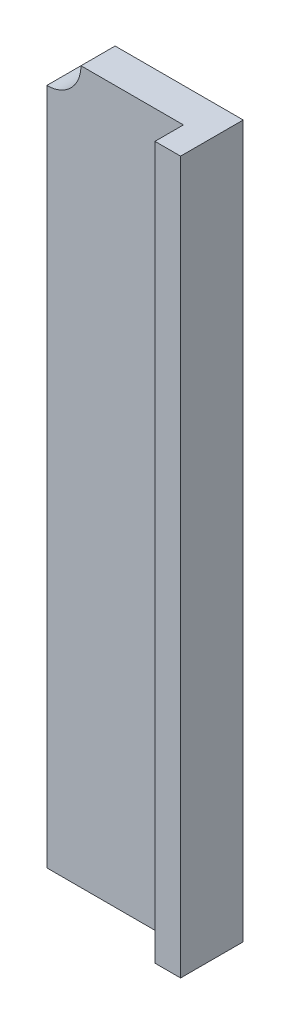
ISO-10303-21;
HEADER;
FILE_DESCRIPTION(('STEP AP214'),'2;1');
FILE_NAME('part.step','',(''),(''),'','','');
FILE_SCHEMA(('AUTOMOTIVE_DESIGN { 1 0 10303 214 1 1 1 1 }'));
ENDSEC;
DATA;
#1=APPLICATION_CONTEXT('core data for automotive mechanical design processes');
#2=APPLICATION_PROTOCOL_DEFINITION('international standard','automotive_design',2000,#1);
#3=PRODUCT_CONTEXT('',#1,'mechanical');
#4=PRODUCT('Part','Part','',(#3));
#5=PRODUCT_RELATED_PRODUCT_CATEGORY('part','',(#4));
#6=PRODUCT_DEFINITION_FORMATION('','',#4);
#7=PRODUCT_DEFINITION_CONTEXT('part definition',#1,'design');
#8=PRODUCT_DEFINITION('design','',#6,#7);
#9=PRODUCT_DEFINITION_SHAPE('','',#8);
#10=(LENGTH_UNIT() NAMED_UNIT(*) SI_UNIT(.MILLI.,.METRE.));
#11=(NAMED_UNIT(*) PLANE_ANGLE_UNIT() SI_UNIT($,.RADIAN.));
#12=(NAMED_UNIT(*) SI_UNIT($,.STERADIAN.) SOLID_ANGLE_UNIT());
#13=UNCERTAINTY_MEASURE_WITH_UNIT(LENGTH_MEASURE(1.E-05),#10,'distance_accuracy_value','');
#14=(GEOMETRIC_REPRESENTATION_CONTEXT(3) GLOBAL_UNCERTAINTY_ASSIGNED_CONTEXT((#13)) GLOBAL_UNIT_ASSIGNED_CONTEXT((#10,
#11,#12)) REPRESENTATION_CONTEXT('',''));
#15=CARTESIAN_POINT('',(0.,0.,0.));
#16=DIRECTION('',(0.,0.,1.));
#17=DIRECTION('',(1.,0.,0.));
#18=AXIS2_PLACEMENT_3D('',#15,#16,#17);
#19=CARTESIAN_POINT('',(0.,0.,6.));
#20=DIRECTION('',(0.,0.,-1.));
#21=DIRECTION('',(-1.,0.,0.));
#22=AXIS2_PLACEMENT_3D('',#19,#20,#21);
#23=PLANE('',#22);
#24=DIRECTION('',(-1.,0.,0.));
#25=VECTOR('',#24,1.);
#26=CARTESIAN_POINT('',(0.,125.,6.));
#27=LINE('',#26,#25);
#28=CARTESIAN_POINT('',(24.,125.,6.));
#29=VERTEX_POINT('',#28);
#30=CARTESIAN_POINT('',(6.,125.,6.));
#31=VERTEX_POINT('',#30);
#32=EDGE_CURVE('E116',#29,#31,#27,.T.);
#33=ORIENTED_EDGE('',*,*,#32,.T.);
#34=CARTESIAN_POINT('',(0.,125.,6.));
#35=DIRECTION('',(0.,0.,1.));
#36=DIRECTION('',(1.,0.,0.));
#37=AXIS2_PLACEMENT_3D('',#34,#35,#36);
#38=CIRCLE('',#37,6.);
#39=CARTESIAN_POINT('',(0.,119.,6.));
#40=VERTEX_POINT('',#39);
#41=EDGE_CURVE('E149',#40,#31,#38,.T.);
#42=ORIENTED_EDGE('',*,*,#41,.F.);
#43=DIRECTION('',(0.,-1.,0.));
#44=VECTOR('',#43,1.);
#45=CARTESIAN_POINT('',(0.,0.,6.));
#46=LINE('',#45,#44);
#47=CARTESIAN_POINT('',(0.,0.,6.));
#48=VERTEX_POINT('',#47);
#49=EDGE_CURVE('E102',#40,#48,#46,.T.);
#50=ORIENTED_EDGE('',*,*,#49,.T.);
#51=DIRECTION('',(1.,0.,0.));
#52=VECTOR('',#51,1.);
#53=CARTESIAN_POINT('',(0.,0.,6.));
#54=LINE('',#53,#52);
#55=CARTESIAN_POINT('',(24.,0.,6.));
#56=VERTEX_POINT('',#55);
#57=EDGE_CURVE('E131',#48,#56,#54,.T.);
#58=ORIENTED_EDGE('',*,*,#57,.T.);
#59=DIRECTION('',(0.,-1.,0.));
#60=VECTOR('',#59,1.);
#61=CARTESIAN_POINT('',(24.,0.,6.));
#62=LINE('',#61,#60);
#63=EDGE_CURVE('E55',#29,#56,#62,.T.);
#64=ORIENTED_EDGE('',*,*,#63,.F.);
#65=EDGE_LOOP('',(#33,#42,#50,#58,#64));
#66=FACE_BOUND('',#65,.T.);
#67=ADVANCED_FACE('F33',(#66),#23,.F.);
#68=CARTESIAN_POINT('',(0.,0.,6.));
#69=DIRECTION('',(1.,0.,0.));
#70=DIRECTION('',(0.,0.,-1.));
#71=AXIS2_PLACEMENT_3D('',#68,#69,#70);
#72=PLANE('',#71);
#73=ORIENTED_EDGE('',*,*,#49,.F.);
#74=DIRECTION('',(0.,0.,1.));
#75=VECTOR('',#74,1.);
#76=CARTESIAN_POINT('',(0.,119.,0.));
#77=LINE('',#76,#75);
#78=CARTESIAN_POINT('',(0.,119.,0.));
#79=VERTEX_POINT('',#78);
#80=EDGE_CURVE('E91',#40,#79,#77,.F.);
#81=ORIENTED_EDGE('',*,*,#80,.T.);
#82=DIRECTION('',(0.,-1.,0.));
#83=VECTOR('',#82,1.);
#84=CARTESIAN_POINT('',(0.,0.,0.));
#85=LINE('',#84,#83);
#86=CARTESIAN_POINT('',(0.,0.,0.));
#87=VERTEX_POINT('',#86);
#88=EDGE_CURVE('E100',#79,#87,#85,.T.);
#89=ORIENTED_EDGE('',*,*,#88,.T.);
#90=DIRECTION('',(0.,0.,-1.));
#91=VECTOR('',#90,1.);
#92=CARTESIAN_POINT('',(0.,0.,6.));
#93=LINE('',#92,#91);
#94=EDGE_CURVE('E41',#48,#87,#93,.T.);
#95=ORIENTED_EDGE('',*,*,#94,.F.);
#96=EDGE_LOOP('',(#73,#81,#89,#95));
#97=FACE_BOUND('',#96,.T.);
#98=ADVANCED_FACE('F35',(#97),#72,.F.);
#99=CARTESIAN_POINT('',(0.,0.,6.));
#100=DIRECTION('',(0.,1.,0.));
#101=DIRECTION('',(0.,0.,1.));
#102=AXIS2_PLACEMENT_3D('',#99,#100,#101);
#103=PLANE('',#102);
#104=DIRECTION('',(1.,0.,0.));
#105=VECTOR('',#104,1.);
#106=CARTESIAN_POINT('',(0.,0.,0.));
#107=LINE('',#106,#105);
#108=CARTESIAN_POINT('',(28.5,0.,0.));
#109=VERTEX_POINT('',#108);
#110=EDGE_CURVE('E106',#87,#109,#107,.T.);
#111=ORIENTED_EDGE('',*,*,#110,.T.);
#112=DIRECTION('',(0.,0.,-1.));
#113=VECTOR('',#112,1.);
#114=CARTESIAN_POINT('',(28.5,0.,6.));
#115=LINE('',#114,#113);
#116=CARTESIAN_POINT('',(28.5,0.,11.));
#117=VERTEX_POINT('',#116);
#118=EDGE_CURVE('E125',#117,#109,#115,.T.);
#119=ORIENTED_EDGE('',*,*,#118,.F.);
#120=DIRECTION('',(1.,0.,0.));
#121=VECTOR('',#120,1.);
#122=CARTESIAN_POINT('',(28.5,0.,11.));
#123=LINE('',#122,#121);
#124=CARTESIAN_POINT('',(24.,0.,11.));
#125=VERTEX_POINT('',#124);
#126=EDGE_CURVE('E137',#125,#117,#123,.T.);
#127=ORIENTED_EDGE('',*,*,#126,.F.);
#128=DIRECTION('',(0.,0.,-1.));
#129=VECTOR('',#128,1.);
#130=CARTESIAN_POINT('',(24.,0.,11.));
#131=LINE('',#130,#129);
#132=EDGE_CURVE('E113',#125,#56,#131,.T.);
#133=ORIENTED_EDGE('',*,*,#132,.T.);
#134=ORIENTED_EDGE('',*,*,#57,.F.);
#135=ORIENTED_EDGE('',*,*,#94,.T.);
#136=EDGE_LOOP('',(#111,#119,#127,#133,#134,#135));
#137=FACE_BOUND('',#136,.T.);
#138=ADVANCED_FACE('F129',(#137),#103,.F.);
#139=CARTESIAN_POINT('',(28.5,0.,6.));
#140=DIRECTION('',(-1.,0.,0.));
#141=DIRECTION('',(0.,0.,1.));
#142=AXIS2_PLACEMENT_3D('',#139,#140,#141);
#143=PLANE('',#142);
#144=DIRECTION('',(0.,1.,0.));
#145=VECTOR('',#144,1.);
#146=CARTESIAN_POINT('',(28.5,0.,0.));
#147=LINE('',#146,#145);
#148=CARTESIAN_POINT('',(28.5,125.,0.));
#149=VERTEX_POINT('',#148);
#150=EDGE_CURVE('E110',#109,#149,#147,.T.);
#151=ORIENTED_EDGE('',*,*,#150,.T.);
#152=DIRECTION('',(0.,0.,-1.));
#153=VECTOR('',#152,1.);
#154=CARTESIAN_POINT('',(28.5,125.,6.));
#155=LINE('',#154,#153);
#156=CARTESIAN_POINT('',(28.5,125.,11.));
#157=VERTEX_POINT('',#156);
#158=EDGE_CURVE('E122',#157,#149,#155,.T.);
#159=ORIENTED_EDGE('',*,*,#158,.F.);
#160=DIRECTION('',(0.,1.,0.));
#161=VECTOR('',#160,1.);
#162=CARTESIAN_POINT('',(28.5,0.,11.));
#163=LINE('',#162,#161);
#164=EDGE_CURVE('E139',#117,#157,#163,.T.);
#165=ORIENTED_EDGE('',*,*,#164,.F.);
#166=ORIENTED_EDGE('',*,*,#118,.T.);
#167=EDGE_LOOP('',(#151,#159,#165,#166));
#168=FACE_BOUND('',#167,.T.);
#169=ADVANCED_FACE('F167',(#168),#143,.F.);
#170=CARTESIAN_POINT('',(0.,125.,6.));
#171=DIRECTION('',(0.,-1.,0.));
#172=DIRECTION('',(0.,0.,-1.));
#173=AXIS2_PLACEMENT_3D('',#170,#171,#172);
#174=PLANE('',#173);
#175=DIRECTION('',(-1.,0.,0.));
#176=VECTOR('',#175,1.);
#177=CARTESIAN_POINT('',(0.,125.,0.));
#178=LINE('',#177,#176);
#179=CARTESIAN_POINT('',(6.,125.,0.));
#180=VERTEX_POINT('',#179);
#181=EDGE_CURVE('E120',#149,#180,#178,.T.);
#182=ORIENTED_EDGE('',*,*,#181,.T.);
#183=DIRECTION('',(0.,0.,1.));
#184=VECTOR('',#183,1.);
#185=CARTESIAN_POINT('',(6.,125.,0.));
#186=LINE('',#185,#184);
#187=EDGE_CURVE('E47',#180,#31,#186,.T.);
#188=ORIENTED_EDGE('',*,*,#187,.T.);
#189=ORIENTED_EDGE('',*,*,#32,.F.);
#190=DIRECTION('',(0.,0.,-1.));
#191=VECTOR('',#190,1.);
#192=CARTESIAN_POINT('',(24.,125.,11.));
#193=LINE('',#192,#191);
#194=CARTESIAN_POINT('',(24.,125.,11.));
#195=VERTEX_POINT('',#194);
#196=EDGE_CURVE('E108',#195,#29,#193,.T.);
#197=ORIENTED_EDGE('',*,*,#196,.F.);
#198=DIRECTION('',(-1.,0.,0.));
#199=VECTOR('',#198,1.);
#200=CARTESIAN_POINT('',(28.5,125.,11.));
#201=LINE('',#200,#199);
#202=EDGE_CURVE('E144',#157,#195,#201,.T.);
#203=ORIENTED_EDGE('',*,*,#202,.F.);
#204=ORIENTED_EDGE('',*,*,#158,.T.);
#205=EDGE_LOOP('',(#182,#188,#189,#197,#203,#204));
#206=FACE_BOUND('',#205,.T.);
#207=ADVANCED_FACE('F151',(#206),#174,.F.);
#208=CARTESIAN_POINT('',(0.,0.,0.));
#209=DIRECTION('',(0.,0.,-1.));
#210=DIRECTION('',(-1.,0.,0.));
#211=AXIS2_PLACEMENT_3D('',#208,#209,#210);
#212=PLANE('',#211);
#213=CARTESIAN_POINT('',(0.,125.,0.));
#214=DIRECTION('',(0.,0.,-1.));
#215=DIRECTION('',(-1.,0.,0.));
#216=AXIS2_PLACEMENT_3D('',#213,#214,#215);
#217=CIRCLE('',#216,6.);
#218=EDGE_CURVE('E11',#180,#79,#217,.T.);
#219=ORIENTED_EDGE('',*,*,#218,.F.);
#220=ORIENTED_EDGE('',*,*,#181,.F.);
#221=ORIENTED_EDGE('',*,*,#150,.F.);
#222=ORIENTED_EDGE('',*,*,#110,.F.);
#223=ORIENTED_EDGE('',*,*,#88,.F.);
#224=EDGE_LOOP('',(#219,#220,#221,#222,#223));
#225=FACE_BOUND('',#224,.T.);
#226=ADVANCED_FACE('F104',(#225),#212,.T.);
#227=CARTESIAN_POINT('',(24.,0.,11.));
#228=DIRECTION('',(1.,0.,0.));
#229=DIRECTION('',(0.,0.,-1.));
#230=AXIS2_PLACEMENT_3D('',#227,#228,#229);
#231=PLANE('',#230);
#232=ORIENTED_EDGE('',*,*,#63,.T.);
#233=ORIENTED_EDGE('',*,*,#132,.F.);
#234=DIRECTION('',(0.,-1.,0.));
#235=VECTOR('',#234,1.);
#236=CARTESIAN_POINT('',(24.,0.,11.));
#237=LINE('',#236,#235);
#238=EDGE_CURVE('E142',#195,#125,#237,.T.);
#239=ORIENTED_EDGE('',*,*,#238,.F.);
#240=ORIENTED_EDGE('',*,*,#196,.T.);
#241=EDGE_LOOP('',(#232,#233,#239,#240));
#242=FACE_BOUND('',#241,.T.);
#243=ADVANCED_FACE('F161',(#242),#231,.F.);
#244=CARTESIAN_POINT('',(0.,0.,11.));
#245=DIRECTION('',(0.,0.,1.));
#246=DIRECTION('',(1.,0.,0.));
#247=AXIS2_PLACEMENT_3D('',#244,#245,#246);
#248=PLANE('',#247);
#249=ORIENTED_EDGE('',*,*,#164,.T.);
#250=ORIENTED_EDGE('',*,*,#202,.T.);
#251=ORIENTED_EDGE('',*,*,#238,.T.);
#252=ORIENTED_EDGE('',*,*,#126,.T.);
#253=EDGE_LOOP('',(#249,#250,#251,#252));
#254=FACE_BOUND('',#253,.T.);
#255=ADVANCED_FACE('F202',(#254),#248,.T.);
#256=CARTESIAN_POINT('',(0.,125.,0.));
#257=DIRECTION('',(0.,0.,1.));
#258=DIRECTION('',(1.,0.,0.));
#259=AXIS2_PLACEMENT_3D('',#256,#257,#258);
#260=CYLINDRICAL_SURFACE('',#259,6.);
#261=ORIENTED_EDGE('',*,*,#41,.T.);
#262=ORIENTED_EDGE('',*,*,#187,.F.);
#263=ORIENTED_EDGE('',*,*,#218,.T.);
#264=ORIENTED_EDGE('',*,*,#80,.F.);
#265=EDGE_LOOP('',(#261,#262,#263,#264));
#266=FACE_BOUND('',#265,.T.);
#267=ADVANCED_FACE('F90',(#266),#260,.F.);
#268=CLOSED_SHELL('',(#67,#98,#138,#169,#207,#226,#243,#255,#267));
#269=MANIFOLD_SOLID_BREP('B2',#268);
#270=ADVANCED_BREP_SHAPE_REPRESENTATION('',(#18,#269),#14);
#271=SHAPE_DEFINITION_REPRESENTATION(#9,#270);
ENDSEC;
END-ISO-10303-21;
